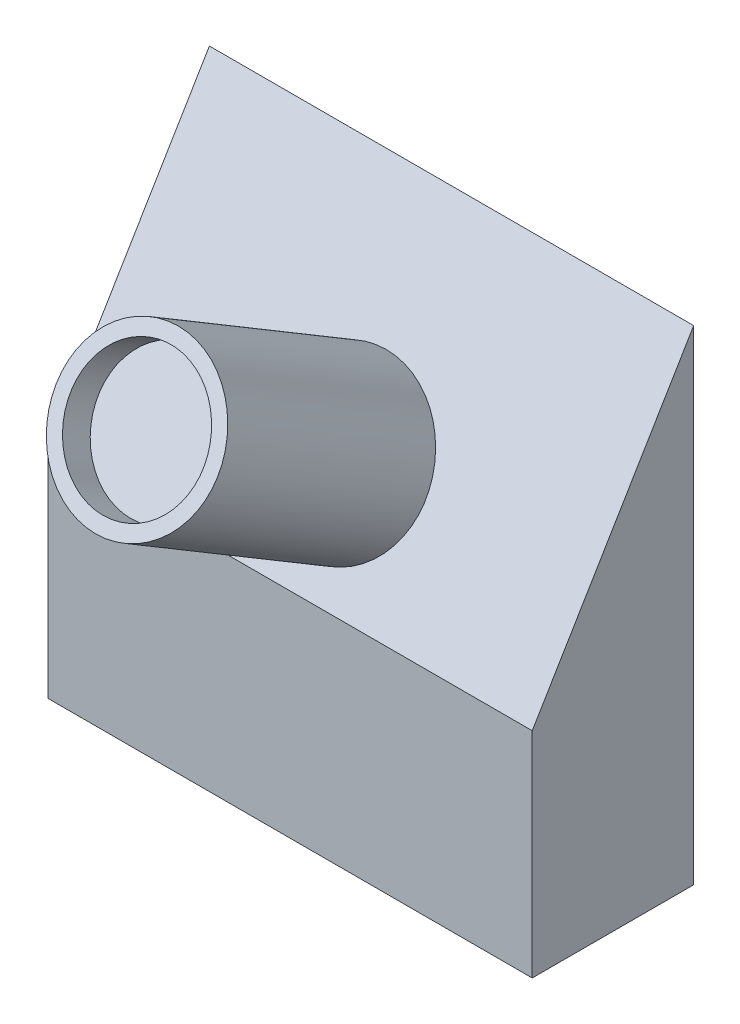
ISO-10303-21;
HEADER;
FILE_DESCRIPTION(('STEP AP214'),'2;1');
FILE_NAME('part.step','',(''),(''),'','','');
FILE_SCHEMA(('AUTOMOTIVE_DESIGN { 1 0 10303 214 1 1 1 1 }'));
ENDSEC;
DATA;
#1=APPLICATION_CONTEXT('core data for automotive mechanical design processes');
#2=APPLICATION_PROTOCOL_DEFINITION('international standard','automotive_design',2000,#1);
#3=PRODUCT_CONTEXT('',#1,'mechanical');
#4=PRODUCT('Part','Part','',(#3));
#5=PRODUCT_RELATED_PRODUCT_CATEGORY('part','',(#4));
#6=PRODUCT_DEFINITION_FORMATION('','',#4);
#7=PRODUCT_DEFINITION_CONTEXT('part definition',#1,'design');
#8=PRODUCT_DEFINITION('design','',#6,#7);
#9=PRODUCT_DEFINITION_SHAPE('','',#8);
#10=(LENGTH_UNIT() NAMED_UNIT(*) SI_UNIT(.MILLI.,.METRE.));
#11=(NAMED_UNIT(*) PLANE_ANGLE_UNIT() SI_UNIT($,.RADIAN.));
#12=(NAMED_UNIT(*) SI_UNIT($,.STERADIAN.) SOLID_ANGLE_UNIT());
#13=UNCERTAINTY_MEASURE_WITH_UNIT(LENGTH_MEASURE(1.E-05),#10,'distance_accuracy_value','');
#14=(GEOMETRIC_REPRESENTATION_CONTEXT(3) GLOBAL_UNCERTAINTY_ASSIGNED_CONTEXT((#13)) GLOBAL_UNIT_ASSIGNED_CONTEXT((#10,
#11,#12)) REPRESENTATION_CONTEXT('',''));
#15=CARTESIAN_POINT('',(0.,0.,0.));
#16=DIRECTION('',(0.,0.,1.));
#17=DIRECTION('',(1.,0.,0.));
#18=AXIS2_PLACEMENT_3D('',#15,#16,#17);
#19=CARTESIAN_POINT('',(15.,15.,10.));
#20=DIRECTION('',(-1.,0.,0.));
#21=DIRECTION('',(0.,0.,1.));
#22=AXIS2_PLACEMENT_3D('',#19,#20,#21);
#23=PLANE('',#22);
#24=DIRECTION('',(0.,1.,0.));
#25=VECTOR('',#24,1.);
#26=CARTESIAN_POINT('',(15.,15.,0.));
#27=LINE('',#26,#25);
#28=CARTESIAN_POINT('',(15.,-15.,0.));
#29=VERTEX_POINT('',#28);
#30=CARTESIAN_POINT('',(15.,15.,0.));
#31=VERTEX_POINT('',#30);
#32=EDGE_CURVE('E94',#29,#31,#27,.T.);
#33=ORIENTED_EDGE('',*,*,#32,.T.);
#34=DIRECTION('',(0.,0.858402301412023,-0.512977084215798));
#35=VECTOR('',#34,1.);
#36=CARTESIAN_POINT('',(15.,15.,0.));
#37=LINE('',#36,#35);
#38=CARTESIAN_POINT('',(15.,-1.73373583001833,10.));
#39=VERTEX_POINT('',#38);
#40=EDGE_CURVE('E125',#39,#31,#37,.T.);
#41=ORIENTED_EDGE('',*,*,#40,.F.);
#42=DIRECTION('',(0.,1.,0.));
#43=VECTOR('',#42,1.);
#44=CARTESIAN_POINT('',(15.,15.,10.));
#45=LINE('',#44,#43);
#46=CARTESIAN_POINT('',(15.,-15.,10.));
#47=VERTEX_POINT('',#46);
#48=EDGE_CURVE('E89',#47,#39,#45,.T.);
#49=ORIENTED_EDGE('',*,*,#48,.F.);
#50=DIRECTION('',(0.,0.,-1.));
#51=VECTOR('',#50,1.);
#52=CARTESIAN_POINT('',(15.,-15.,10.));
#53=LINE('',#52,#51);
#54=EDGE_CURVE('E84',#47,#29,#53,.T.);
#55=ORIENTED_EDGE('',*,*,#54,.T.);
#56=EDGE_LOOP('',(#33,#41,#49,#55));
#57=FACE_BOUND('',#56,.T.);
#58=ADVANCED_FACE('F45',(#57),#23,.F.);
#59=CARTESIAN_POINT('',(-15.,15.,10.));
#60=DIRECTION('',(1.,0.,0.));
#61=DIRECTION('',(0.,1.,0.));
#62=AXIS2_PLACEMENT_3D('',#59,#60,#61);
#63=PLANE('',#62);
#64=DIRECTION('',(0.,-1.,0.));
#65=VECTOR('',#64,1.);
#66=CARTESIAN_POINT('',(-15.,15.,10.));
#67=LINE('',#66,#65);
#68=CARTESIAN_POINT('',(-15.,-1.73373583001833,10.));
#69=VERTEX_POINT('',#68);
#70=CARTESIAN_POINT('',(-15.,-15.,10.));
#71=VERTEX_POINT('',#70);
#72=EDGE_CURVE('E116',#69,#71,#67,.T.);
#73=ORIENTED_EDGE('',*,*,#72,.F.);
#74=DIRECTION('',(0.,0.858402301412023,-0.512977084215798));
#75=VECTOR('',#74,1.);
#76=CARTESIAN_POINT('',(-15.,10.5965929033753,2.63145488930542));
#77=LINE('',#76,#75);
#78=CARTESIAN_POINT('',(-15.,15.,0.));
#79=VERTEX_POINT('',#78);
#80=EDGE_CURVE('E102',#69,#79,#77,.T.);
#81=ORIENTED_EDGE('',*,*,#80,.T.);
#82=DIRECTION('',(0.,-1.,0.));
#83=VECTOR('',#82,1.);
#84=CARTESIAN_POINT('',(-15.,15.,0.));
#85=LINE('',#84,#83);
#86=CARTESIAN_POINT('',(-15.,-15.,0.));
#87=VERTEX_POINT('',#86);
#88=EDGE_CURVE('E76',#79,#87,#85,.T.);
#89=ORIENTED_EDGE('',*,*,#88,.T.);
#90=DIRECTION('',(0.,0.,-1.));
#91=VECTOR('',#90,1.);
#92=CARTESIAN_POINT('',(-15.,-15.,10.));
#93=LINE('',#92,#91);
#94=EDGE_CURVE('E54',#71,#87,#93,.T.);
#95=ORIENTED_EDGE('',*,*,#94,.F.);
#96=EDGE_LOOP('',(#73,#81,#89,#95));
#97=FACE_BOUND('',#96,.T.);
#98=ADVANCED_FACE('F171',(#97),#63,.F.);
#99=CARTESIAN_POINT('',(-15.,-15.,10.));
#100=DIRECTION('',(0.,1.,0.));
#101=DIRECTION('',(0.,0.,1.));
#102=AXIS2_PLACEMENT_3D('',#99,#100,#101);
#103=PLANE('',#102);
#104=DIRECTION('',(1.,0.,0.));
#105=VECTOR('',#104,1.);
#106=CARTESIAN_POINT('',(-15.,-15.,0.));
#107=LINE('',#106,#105);
#108=EDGE_CURVE('E81',#87,#29,#107,.T.);
#109=ORIENTED_EDGE('',*,*,#108,.T.);
#110=ORIENTED_EDGE('',*,*,#54,.F.);
#111=DIRECTION('',(1.,0.,0.));
#112=VECTOR('',#111,1.);
#113=CARTESIAN_POINT('',(-15.,-15.,10.));
#114=LINE('',#113,#112);
#115=EDGE_CURVE('E62',#71,#47,#114,.T.);
#116=ORIENTED_EDGE('',*,*,#115,.F.);
#117=ORIENTED_EDGE('',*,*,#94,.T.);
#118=EDGE_LOOP('',(#109,#110,#116,#117));
#119=FACE_BOUND('',#118,.T.);
#120=ADVANCED_FACE('F83',(#119),#103,.F.);
#121=CARTESIAN_POINT('',(0.,0.,10.));
#122=DIRECTION('',(0.,0.,1.));
#123=DIRECTION('',(1.,0.,0.));
#124=AXIS2_PLACEMENT_3D('',#121,#122,#123);
#125=PLANE('',#124);
#126=DIRECTION('',(1.,0.,0.));
#127=VECTOR('',#126,1.);
#128=CARTESIAN_POINT('',(-21.,-1.73373583001833,10.));
#129=LINE('',#128,#127);
#130=EDGE_CURVE('E107',#69,#39,#129,.T.);
#131=ORIENTED_EDGE('',*,*,#130,.F.);
#132=ORIENTED_EDGE('',*,*,#72,.T.);
#133=ORIENTED_EDGE('',*,*,#115,.T.);
#134=ORIENTED_EDGE('',*,*,#48,.T.);
#135=EDGE_LOOP('',(#131,#132,#133,#134));
#136=FACE_BOUND('',#135,.T.);
#137=ADVANCED_FACE('F169',(#136),#125,.T.);
#138=CARTESIAN_POINT('',(0.,0.,0.));
#139=DIRECTION('',(0.,0.,1.));
#140=DIRECTION('',(1.,0.,0.));
#141=AXIS2_PLACEMENT_3D('',#138,#139,#140);
#142=PLANE('',#141);
#143=ORIENTED_EDGE('',*,*,#32,.F.);
#144=ORIENTED_EDGE('',*,*,#108,.F.);
#145=ORIENTED_EDGE('',*,*,#88,.F.);
#146=DIRECTION('',(-1.,0.,0.));
#147=VECTOR('',#146,1.);
#148=CARTESIAN_POINT('',(-15.,15.,0.));
#149=LINE('',#148,#147);
#150=EDGE_CURVE('E100',#31,#79,#149,.T.);
#151=ORIENTED_EDGE('',*,*,#150,.F.);
#152=EDGE_LOOP('',(#143,#144,#145,#151));
#153=FACE_BOUND('',#152,.T.);
#154=ADVANCED_FACE('F98',(#153),#142,.F.);
#155=CARTESIAN_POINT('',(-21.,15.,0.));
#156=DIRECTION('',(0.,-0.512977084215798,-0.858402301412023));
#157=DIRECTION('',(0.,0.858402301412023,-0.512977084215798));
#158=AXIS2_PLACEMENT_3D('',#155,#156,#157);
#159=PLANE('',#158);
#160=CARTESIAN_POINT('',(0.,3.94718233395813,6.60511064493705));
#161=DIRECTION('',(0.,-0.512977084215798,-0.858402301412023));
#162=DIRECTION('',(0.,0.858402301412023,-0.512977084215798));
#163=AXIS2_PLACEMENT_3D('',#160,#161,#162);
#164=CIRCLE('',#163,5.);
#165=CARTESIAN_POINT('',(0.,8.23919384101825,4.04022522385806));
#166=VERTEX_POINT('',#165);
#167=EDGE_CURVE('E11',#166,#166,#164,.F.);
#168=ORIENTED_EDGE('',*,*,#167,.F.);
#169=EDGE_LOOP('',(#168));
#170=FACE_BOUND('',#169,.T.);
#171=ORIENTED_EDGE('',*,*,#130,.T.);
#172=ORIENTED_EDGE('',*,*,#40,.T.);
#173=ORIENTED_EDGE('',*,*,#150,.T.);
#174=ORIENTED_EDGE('',*,*,#80,.F.);
#175=EDGE_LOOP('',(#171,#172,#173,#174));
#176=FACE_BOUND('',#175,.T.);
#177=ADVANCED_FACE('F158',(#170,#176),#159,.F.);
#178=CARTESIAN_POINT('',(0.,11.6418385971951,19.4811451661174));
#179=DIRECTION('',(0.,-0.512977084215798,-0.858402301412023));
#180=DIRECTION('',(0.,0.858402301412023,-0.512977084215798));
#181=AXIS2_PLACEMENT_3D('',#178,#179,#180);
#182=CYLINDRICAL_SURFACE('',#181,5.);
#183=CARTESIAN_POINT('',(0.,11.6418385971951,19.4811451661174));
#184=DIRECTION('',(0.,0.512977084215798,0.858402301412023));
#185=DIRECTION('',(0.,-0.858402301412023,0.512977084215798));
#186=AXIS2_PLACEMENT_3D('',#183,#184,#185);
#187=CIRCLE('',#186,5.);
#188=CARTESIAN_POINT('',(0.,7.34982709013499,22.0460305871964));
#189=VERTEX_POINT('',#188);
#190=EDGE_CURVE('E128',#189,#189,#187,.T.);
#191=ORIENTED_EDGE('',*,*,#190,.F.);
#192=EDGE_LOOP('',(#191));
#193=FACE_BOUND('',#192,.T.);
#194=ORIENTED_EDGE('',*,*,#167,.T.);
#195=EDGE_LOOP('',(#194));
#196=FACE_BOUND('',#195,.T.);
#197=ADVANCED_FACE('F152',(#193,#196),#182,.T.);
#198=CARTESIAN_POINT('',(0.,11.6418385971951,19.4811451661174));
#199=DIRECTION('',(0.,0.512977084215798,0.858402301412023));
#200=DIRECTION('',(0.,-0.858402301412023,0.512977084215798));
#201=AXIS2_PLACEMENT_3D('',#198,#199,#200);
#202=PLANE('',#201);
#203=CARTESIAN_POINT('',(0.,11.6418385971951,19.4811451661174));
#204=DIRECTION('',(0.,0.512977084215798,0.858402301412023));
#205=DIRECTION('',(0.,-0.858402301412023,0.512977084215798));
#206=AXIS2_PLACEMENT_3D('',#203,#204,#205);
#207=CIRCLE('',#206,4.10994084659565);
#208=CARTESIAN_POINT('',(0.,8.11385591581013,21.5894506379034));
#209=VERTEX_POINT('',#208);
#210=EDGE_CURVE('E133',#209,#209,#207,.T.);
#211=ORIENTED_EDGE('',*,*,#210,.F.);
#212=EDGE_LOOP('',(#211));
#213=FACE_BOUND('',#212,.T.);
#214=ORIENTED_EDGE('',*,*,#190,.T.);
#215=EDGE_LOOP('',(#214));
#216=FACE_BOUND('',#215,.T.);
#217=ADVANCED_FACE('F146',(#213,#216),#202,.T.);
#218=CARTESIAN_POINT('',(0.,10.6158844287635,17.7643405632934));
#219=DIRECTION('',(0.,0.512977084215798,0.858402301412023));
#220=DIRECTION('',(0.,-0.858402301412023,0.512977084215798));
#221=AXIS2_PLACEMENT_3D('',#218,#219,#220);
#222=CYLINDRICAL_SURFACE('',#221,4.10994084659565);
#223=CARTESIAN_POINT('',(0.,10.6158844287635,17.7643405632934));
#224=DIRECTION('',(0.,0.512977084215798,0.858402301412023));
#225=DIRECTION('',(0.,-0.858402301412023,0.512977084215798));
#226=AXIS2_PLACEMENT_3D('',#223,#224,#225);
#227=CIRCLE('',#226,4.10994084659565);
#228=CARTESIAN_POINT('',(0.,7.08790174737853,19.8726460350794));
#229=VERTEX_POINT('',#228);
#230=EDGE_CURVE('E132',#229,#229,#227,.T.);
#231=ORIENTED_EDGE('',*,*,#230,.F.);
#232=EDGE_LOOP('',(#231));
#233=FACE_BOUND('',#232,.T.);
#234=ORIENTED_EDGE('',*,*,#210,.T.);
#235=EDGE_LOOP('',(#234));
#236=FACE_BOUND('',#235,.T.);
#237=ADVANCED_FACE('F143',(#233,#236),#222,.F.);
#238=CARTESIAN_POINT('',(0.,10.6158844287635,17.7643405632934));
#239=DIRECTION('',(0.,0.512977084215798,0.858402301412023));
#240=DIRECTION('',(0.,-0.858402301412023,0.512977084215798));
#241=AXIS2_PLACEMENT_3D('',#238,#239,#240);
#242=PLANE('',#241);
#243=ORIENTED_EDGE('',*,*,#230,.T.);
#244=EDGE_LOOP('',(#243));
#245=FACE_BOUND('',#244,.T.);
#246=ADVANCED_FACE('F141',(#245),#242,.T.);
#247=CLOSED_SHELL('',(#58,#98,#120,#137,#154,#177,#197,#217,#237,#246));
#248=MANIFOLD_SOLID_BREP('B2',#247);
#249=ADVANCED_BREP_SHAPE_REPRESENTATION('',(#18,#248),#14);
#250=SHAPE_DEFINITION_REPRESENTATION(#9,#249);
ENDSEC;
END-ISO-10303-21;
